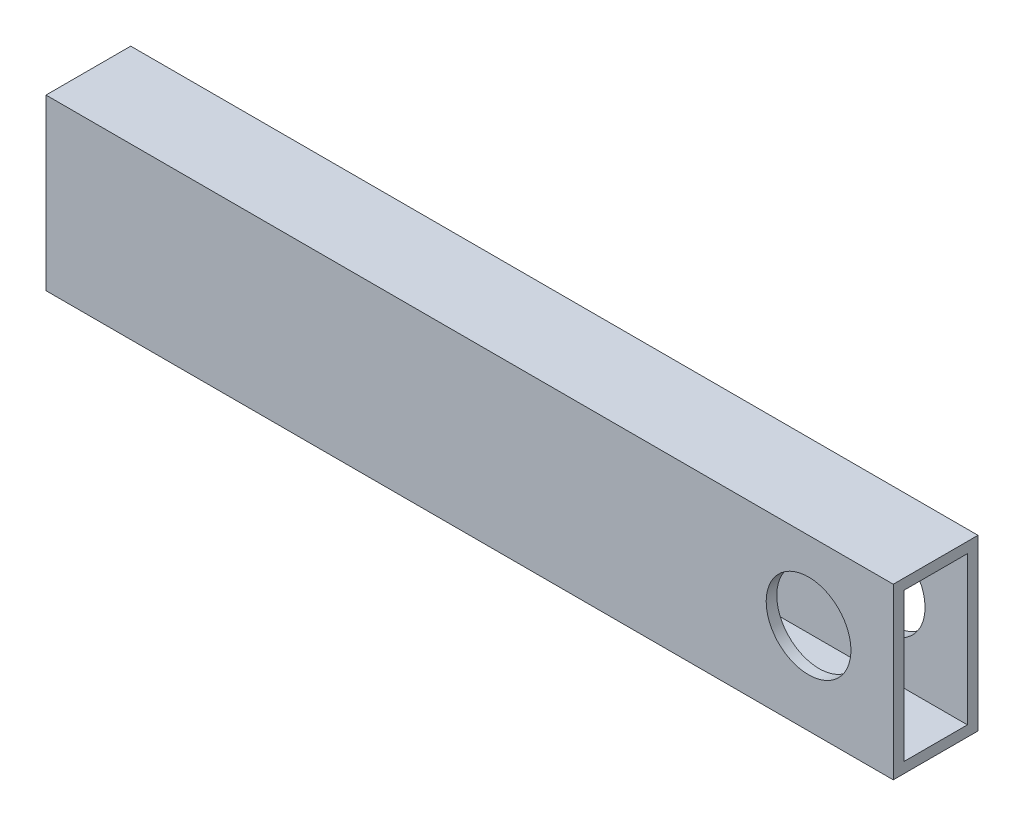
ISO-10303-21;
HEADER;
FILE_DESCRIPTION(('STEP AP214'),'2;1');
FILE_NAME('part.step','',(''),(''),'','','');
FILE_SCHEMA(('AUTOMOTIVE_DESIGN { 1 0 10303 214 1 1 1 1 }'));
ENDSEC;
DATA;
#1=APPLICATION_CONTEXT('core data for automotive mechanical design processes');
#2=APPLICATION_PROTOCOL_DEFINITION('international standard','automotive_design',2000,#1);
#3=PRODUCT_CONTEXT('',#1,'mechanical');
#4=PRODUCT('Part','Part','',(#3));
#5=PRODUCT_RELATED_PRODUCT_CATEGORY('part','',(#4));
#6=PRODUCT_DEFINITION_FORMATION('','',#4);
#7=PRODUCT_DEFINITION_CONTEXT('part definition',#1,'design');
#8=PRODUCT_DEFINITION('design','',#6,#7);
#9=PRODUCT_DEFINITION_SHAPE('','',#8);
#10=(LENGTH_UNIT() NAMED_UNIT(*) SI_UNIT(.MILLI.,.METRE.));
#11=(NAMED_UNIT(*) PLANE_ANGLE_UNIT() SI_UNIT($,.RADIAN.));
#12=(NAMED_UNIT(*) SI_UNIT($,.STERADIAN.) SOLID_ANGLE_UNIT());
#13=UNCERTAINTY_MEASURE_WITH_UNIT(LENGTH_MEASURE(1.E-05),#10,'distance_accuracy_value','');
#14=(GEOMETRIC_REPRESENTATION_CONTEXT(3) GLOBAL_UNCERTAINTY_ASSIGNED_CONTEXT((#13)) GLOBAL_UNIT_ASSIGNED_CONTEXT((#10,
#11,#12)) REPRESENTATION_CONTEXT('',''));
#15=CARTESIAN_POINT('',(0.,0.,0.));
#16=DIRECTION('',(0.,0.,1.));
#17=DIRECTION('',(1.,0.,0.));
#18=AXIS2_PLACEMENT_3D('',#15,#16,#17);
#19=CARTESIAN_POINT('',(304.8,0.,0.));
#20=DIRECTION('',(-1.,0.,0.));
#21=DIRECTION('',(0.,0.,1.));
#22=AXIS2_PLACEMENT_3D('',#19,#20,#21);
#23=PLANE('',#22);
#24=DIRECTION('',(0.,-1.,0.));
#25=VECTOR('',#24,1.);
#26=CARTESIAN_POINT('',(304.8,0.,0.));
#27=LINE('',#26,#25);
#28=CARTESIAN_POINT('',(304.8,50.8,0.));
#29=VERTEX_POINT('',#28);
#30=CARTESIAN_POINT('',(304.8,0.,0.));
#31=VERTEX_POINT('',#30);
#32=EDGE_CURVE('E164',#29,#31,#27,.T.);
#33=ORIENTED_EDGE('',*,*,#32,.T.);
#34=DIRECTION('',(0.,0.,-1.));
#35=VECTOR('',#34,1.);
#36=CARTESIAN_POINT('',(304.8,0.,0.));
#37=LINE('',#36,#35);
#38=CARTESIAN_POINT('',(304.8,0.,-25.4));
#39=VERTEX_POINT('',#38);
#40=EDGE_CURVE('E167',#31,#39,#37,.T.);
#41=ORIENTED_EDGE('',*,*,#40,.T.);
#42=DIRECTION('',(0.,1.,0.));
#43=VECTOR('',#42,1.);
#44=CARTESIAN_POINT('',(304.8,0.,-25.4));
#45=LINE('',#44,#43);
#46=CARTESIAN_POINT('',(304.8,50.8,-25.4));
#47=VERTEX_POINT('',#46);
#48=EDGE_CURVE('E169',#39,#47,#45,.T.);
#49=ORIENTED_EDGE('',*,*,#48,.T.);
#50=DIRECTION('',(0.,0.,1.));
#51=VECTOR('',#50,1.);
#52=CARTESIAN_POINT('',(304.8,50.8,0.));
#53=LINE('',#52,#51);
#54=EDGE_CURVE('E116',#47,#29,#53,.T.);
#55=ORIENTED_EDGE('',*,*,#54,.T.);
#56=EDGE_LOOP('',(#33,#41,#49,#55));
#57=FACE_BOUND('',#56,.T.);
#58=DIRECTION('',(0.,-1.,0.));
#59=VECTOR('',#58,1.);
#60=CARTESIAN_POINT('',(304.8,47.625,-3.175));
#61=LINE('',#60,#59);
#62=CARTESIAN_POINT('',(304.8,47.625,-3.175));
#63=VERTEX_POINT('',#62);
#64=CARTESIAN_POINT('',(304.8,3.175,-3.175));
#65=VERTEX_POINT('',#64);
#66=EDGE_CURVE('E143',#63,#65,#61,.T.);
#67=ORIENTED_EDGE('',*,*,#66,.F.);
#68=DIRECTION('',(0.,0.,1.));
#69=VECTOR('',#68,1.);
#70=CARTESIAN_POINT('',(304.8,47.625,-3.175));
#71=LINE('',#70,#69);
#72=CARTESIAN_POINT('',(304.8,47.625,-22.225));
#73=VERTEX_POINT('',#72);
#74=EDGE_CURVE('E150',#73,#63,#71,.T.);
#75=ORIENTED_EDGE('',*,*,#74,.F.);
#76=DIRECTION('',(0.,1.,0.));
#77=VECTOR('',#76,1.);
#78=CARTESIAN_POINT('',(304.8,47.625,-22.225));
#79=LINE('',#78,#77);
#80=CARTESIAN_POINT('',(304.8,3.175,-22.225));
#81=VERTEX_POINT('',#80);
#82=EDGE_CURVE('E147',#81,#73,#79,.T.);
#83=ORIENTED_EDGE('',*,*,#82,.F.);
#84=DIRECTION('',(0.,0.,-1.));
#85=VECTOR('',#84,1.);
#86=CARTESIAN_POINT('',(304.8,3.175,-3.175));
#87=LINE('',#86,#85);
#88=EDGE_CURVE('E145',#65,#81,#87,.T.);
#89=ORIENTED_EDGE('',*,*,#88,.F.);
#90=EDGE_LOOP('',(#67,#75,#83,#89));
#91=FACE_BOUND('',#90,.T.);
#92=ADVANCED_FACE('F34',(#57,#91),#23,.F.);
#93=CARTESIAN_POINT('',(304.8,0.,0.));
#94=DIRECTION('',(0.,0.,-1.));
#95=DIRECTION('',(-1.,0.,0.));
#96=AXIS2_PLACEMENT_3D('',#93,#94,#95);
#97=PLANE('',#96);
#98=CARTESIAN_POINT('',(279.4,27.2832700277928,0.));
#99=DIRECTION('',(0.,0.,-1.));
#100=DIRECTION('',(-1.,0.,0.));
#101=AXIS2_PLACEMENT_3D('',#98,#99,#100);
#102=CIRCLE('',#101,12.7);
#103=CARTESIAN_POINT('',(266.7,27.2832700277928,0.));
#104=VERTEX_POINT('',#103);
#105=EDGE_CURVE('E127',#104,#104,#102,.T.);
#106=ORIENTED_EDGE('',*,*,#105,.T.);
#107=EDGE_LOOP('',(#106));
#108=FACE_BOUND('',#107,.T.);
#109=DIRECTION('',(-1.,0.,0.));
#110=VECTOR('',#109,1.);
#111=CARTESIAN_POINT('',(304.8,50.8,0.));
#112=LINE('',#111,#110);
#113=CARTESIAN_POINT('',(50.8000000000001,50.8,0.));
#114=VERTEX_POINT('',#113);
#115=EDGE_CURVE('E117',#29,#114,#112,.T.);
#116=ORIENTED_EDGE('',*,*,#115,.T.);
#117=DIRECTION('',(0.,-1.,0.));
#118=VECTOR('',#117,1.);
#119=CARTESIAN_POINT('',(50.8,0.,0.));
#120=LINE('',#119,#118);
#121=CARTESIAN_POINT('',(50.8,0.,0.));
#122=VERTEX_POINT('',#121);
#123=EDGE_CURVE('E49',#114,#122,#120,.T.);
#124=ORIENTED_EDGE('',*,*,#123,.T.);
#125=DIRECTION('',(-1.,0.,0.));
#126=VECTOR('',#125,1.);
#127=CARTESIAN_POINT('',(304.8,0.,0.));
#128=LINE('',#127,#126);
#129=EDGE_CURVE('E42',#31,#122,#128,.T.);
#130=ORIENTED_EDGE('',*,*,#129,.F.);
#131=ORIENTED_EDGE('',*,*,#32,.F.);
#132=EDGE_LOOP('',(#116,#124,#130,#131));
#133=FACE_BOUND('',#132,.T.);
#134=ADVANCED_FACE('F36',(#108,#133),#97,.F.);
#135=CARTESIAN_POINT('',(304.8,0.,0.));
#136=DIRECTION('',(0.,1.,0.));
#137=DIRECTION('',(0.,0.,1.));
#138=AXIS2_PLACEMENT_3D('',#135,#136,#137);
#139=PLANE('',#138);
#140=ORIENTED_EDGE('',*,*,#129,.T.);
#141=DIRECTION('',(0.,0.,-1.));
#142=VECTOR('',#141,1.);
#143=CARTESIAN_POINT('',(50.8,0.,0.));
#144=LINE('',#143,#142);
#145=CARTESIAN_POINT('',(50.8,0.,-25.4));
#146=VERTEX_POINT('',#145);
#147=EDGE_CURVE('E137',#122,#146,#144,.T.);
#148=ORIENTED_EDGE('',*,*,#147,.T.);
#149=DIRECTION('',(-1.,0.,0.));
#150=VECTOR('',#149,1.);
#151=CARTESIAN_POINT('',(304.8,0.,-25.4));
#152=LINE('',#151,#150);
#153=EDGE_CURVE('E113',#39,#146,#152,.T.);
#154=ORIENTED_EDGE('',*,*,#153,.F.);
#155=ORIENTED_EDGE('',*,*,#40,.F.);
#156=EDGE_LOOP('',(#140,#148,#154,#155));
#157=FACE_BOUND('',#156,.T.);
#158=ADVANCED_FACE('F176',(#157),#139,.F.);
#159=CARTESIAN_POINT('',(304.8,0.,-25.4));
#160=DIRECTION('',(0.,0.,1.));
#161=DIRECTION('',(1.,0.,0.));
#162=AXIS2_PLACEMENT_3D('',#159,#160,#161);
#163=PLANE('',#162);
#164=CARTESIAN_POINT('',(279.4,27.2832700277928,-25.4));
#165=DIRECTION('',(0.,0.,1.));
#166=DIRECTION('',(1.,0.,0.));
#167=AXIS2_PLACEMENT_3D('',#164,#165,#166);
#168=CIRCLE('',#167,12.7);
#169=CARTESIAN_POINT('',(292.1,27.2832700277928,-25.4));
#170=VERTEX_POINT('',#169);
#171=EDGE_CURVE('E131',#170,#170,#168,.T.);
#172=ORIENTED_EDGE('',*,*,#171,.T.);
#173=EDGE_LOOP('',(#172));
#174=FACE_BOUND('',#173,.T.);
#175=ORIENTED_EDGE('',*,*,#153,.T.);
#176=DIRECTION('',(0.,-1.,0.));
#177=VECTOR('',#176,1.);
#178=CARTESIAN_POINT('',(50.8,50.8,-25.4));
#179=LINE('',#178,#177);
#180=CARTESIAN_POINT('',(50.8,50.8,-25.4));
#181=VERTEX_POINT('',#180);
#182=EDGE_CURVE('E98',#181,#146,#179,.T.);
#183=ORIENTED_EDGE('',*,*,#182,.F.);
#184=DIRECTION('',(-1.,0.,0.));
#185=VECTOR('',#184,1.);
#186=CARTESIAN_POINT('',(304.8,50.8,-25.4));
#187=LINE('',#186,#185);
#188=EDGE_CURVE('E110',#47,#181,#187,.T.);
#189=ORIENTED_EDGE('',*,*,#188,.F.);
#190=ORIENTED_EDGE('',*,*,#48,.F.);
#191=EDGE_LOOP('',(#175,#183,#189,#190));
#192=FACE_BOUND('',#191,.T.);
#193=ADVANCED_FACE('F108',(#174,#192),#163,.F.);
#194=CARTESIAN_POINT('',(304.8,50.8,0.));
#195=DIRECTION('',(0.,-1.,0.));
#196=DIRECTION('',(0.,0.,-1.));
#197=AXIS2_PLACEMENT_3D('',#194,#195,#196);
#198=PLANE('',#197);
#199=ORIENTED_EDGE('',*,*,#188,.T.);
#200=DIRECTION('',(0.,0.,-1.));
#201=VECTOR('',#200,1.);
#202=CARTESIAN_POINT('',(50.8,50.8,133.604));
#203=LINE('',#202,#201);
#204=EDGE_CURVE('E95',#114,#181,#203,.T.);
#205=ORIENTED_EDGE('',*,*,#204,.F.);
#206=ORIENTED_EDGE('',*,*,#115,.F.);
#207=ORIENTED_EDGE('',*,*,#54,.F.);
#208=EDGE_LOOP('',(#199,#205,#206,#207));
#209=FACE_BOUND('',#208,.T.);
#210=ADVANCED_FACE('F115',(#209),#198,.F.);
#211=CARTESIAN_POINT('',(304.8,47.625,-3.175));
#212=DIRECTION('',(0.,0.,-1.));
#213=DIRECTION('',(0.,1.,0.));
#214=AXIS2_PLACEMENT_3D('',#211,#212,#213);
#215=PLANE('',#214);
#216=DIRECTION('',(0.,-1.,0.));
#217=VECTOR('',#216,1.);
#218=CARTESIAN_POINT('',(50.8,47.625,-3.175));
#219=LINE('',#218,#217);
#220=CARTESIAN_POINT('',(50.8,47.625,-3.175));
#221=VERTEX_POINT('',#220);
#222=CARTESIAN_POINT('',(50.8,3.175,-3.175));
#223=VERTEX_POINT('',#222);
#224=EDGE_CURVE('E177',#221,#223,#219,.T.);
#225=ORIENTED_EDGE('',*,*,#224,.F.);
#226=DIRECTION('',(-1.,0.,0.));
#227=VECTOR('',#226,1.);
#228=CARTESIAN_POINT('',(304.8,47.625,-3.175));
#229=LINE('',#228,#227);
#230=EDGE_CURVE('E152',#63,#221,#229,.T.);
#231=ORIENTED_EDGE('',*,*,#230,.F.);
#232=ORIENTED_EDGE('',*,*,#66,.T.);
#233=DIRECTION('',(-1.,0.,0.));
#234=VECTOR('',#233,1.);
#235=CARTESIAN_POINT('',(304.8,3.175,-3.175));
#236=LINE('',#235,#234);
#237=EDGE_CURVE('E161',#65,#223,#236,.T.);
#238=ORIENTED_EDGE('',*,*,#237,.T.);
#239=EDGE_LOOP('',(#225,#231,#232,#238));
#240=FACE_BOUND('',#239,.T.);
#241=CARTESIAN_POINT('',(279.4,27.2832700277928,-3.175));
#242=DIRECTION('',(0.,0.,-1.));
#243=DIRECTION('',(0.,1.,0.));
#244=AXIS2_PLACEMENT_3D('',#241,#242,#243);
#245=CIRCLE('',#244,12.7);
#246=CARTESIAN_POINT('',(279.4,39.9832700277928,-3.175));
#247=VERTEX_POINT('',#246);
#248=EDGE_CURVE('E126',#247,#247,#245,.T.);
#249=ORIENTED_EDGE('',*,*,#248,.F.);
#250=EDGE_LOOP('',(#249));
#251=FACE_BOUND('',#250,.T.);
#252=ADVANCED_FACE('F199',(#240,#251),#215,.T.);
#253=CARTESIAN_POINT('',(304.8,3.175,-3.175));
#254=DIRECTION('',(0.,1.,0.));
#255=DIRECTION('',(0.,0.,1.));
#256=AXIS2_PLACEMENT_3D('',#253,#254,#255);
#257=PLANE('',#256);
#258=DIRECTION('',(0.,0.,-1.));
#259=VECTOR('',#258,1.);
#260=CARTESIAN_POINT('',(50.8,3.175,-3.175));
#261=LINE('',#260,#259);
#262=CARTESIAN_POINT('',(50.8,3.175,-22.225));
#263=VERTEX_POINT('',#262);
#264=EDGE_CURVE('E178',#223,#263,#261,.T.);
#265=ORIENTED_EDGE('',*,*,#264,.F.);
#266=ORIENTED_EDGE('',*,*,#237,.F.);
#267=ORIENTED_EDGE('',*,*,#88,.T.);
#268=DIRECTION('',(-1.,0.,0.));
#269=VECTOR('',#268,1.);
#270=CARTESIAN_POINT('',(304.8,3.175,-22.225));
#271=LINE('',#270,#269);
#272=EDGE_CURVE('E158',#81,#263,#271,.T.);
#273=ORIENTED_EDGE('',*,*,#272,.T.);
#274=EDGE_LOOP('',(#265,#266,#267,#273));
#275=FACE_BOUND('',#274,.T.);
#276=ADVANCED_FACE('F191',(#275),#257,.T.);
#277=CARTESIAN_POINT('',(304.8,47.625,-22.225));
#278=DIRECTION('',(0.,0.,1.));
#279=DIRECTION('',(0.,-1.,0.));
#280=AXIS2_PLACEMENT_3D('',#277,#278,#279);
#281=PLANE('',#280);
#282=DIRECTION('',(0.,1.,0.));
#283=VECTOR('',#282,1.);
#284=CARTESIAN_POINT('',(50.8,47.625,-22.225));
#285=LINE('',#284,#283);
#286=CARTESIAN_POINT('',(50.8000000000001,47.625,-22.225));
#287=VERTEX_POINT('',#286);
#288=EDGE_CURVE('E56',#263,#287,#285,.T.);
#289=ORIENTED_EDGE('',*,*,#288,.F.);
#290=ORIENTED_EDGE('',*,*,#272,.F.);
#291=ORIENTED_EDGE('',*,*,#82,.T.);
#292=DIRECTION('',(-1.,0.,0.));
#293=VECTOR('',#292,1.);
#294=CARTESIAN_POINT('',(304.8,47.625,-22.225));
#295=LINE('',#294,#293);
#296=EDGE_CURVE('E155',#73,#287,#295,.T.);
#297=ORIENTED_EDGE('',*,*,#296,.T.);
#298=EDGE_LOOP('',(#289,#290,#291,#297));
#299=FACE_BOUND('',#298,.T.);
#300=CARTESIAN_POINT('',(279.4,27.2832700277928,-22.225));
#301=DIRECTION('',(0.,0.,1.));
#302=DIRECTION('',(0.,-1.,0.));
#303=AXIS2_PLACEMENT_3D('',#300,#301,#302);
#304=CIRCLE('',#303,12.7);
#305=CARTESIAN_POINT('',(279.4,14.5832700277928,-22.225));
#306=VERTEX_POINT('',#305);
#307=EDGE_CURVE('E124',#306,#306,#304,.T.);
#308=ORIENTED_EDGE('',*,*,#307,.F.);
#309=EDGE_LOOP('',(#308));
#310=FACE_BOUND('',#309,.T.);
#311=ADVANCED_FACE('F188',(#299,#310),#281,.T.);
#312=CARTESIAN_POINT('',(304.8,47.625,-3.175));
#313=DIRECTION('',(0.,-1.,0.));
#314=DIRECTION('',(0.,0.,-1.));
#315=AXIS2_PLACEMENT_3D('',#312,#313,#314);
#316=PLANE('',#315);
#317=DIRECTION('',(0.,0.,1.));
#318=VECTOR('',#317,1.);
#319=CARTESIAN_POINT('',(50.8,47.625,-3.175));
#320=LINE('',#319,#318);
#321=EDGE_CURVE('E11',#287,#221,#320,.T.);
#322=ORIENTED_EDGE('',*,*,#321,.F.);
#323=ORIENTED_EDGE('',*,*,#296,.F.);
#324=ORIENTED_EDGE('',*,*,#74,.T.);
#325=ORIENTED_EDGE('',*,*,#230,.T.);
#326=EDGE_LOOP('',(#322,#323,#324,#325));
#327=FACE_BOUND('',#326,.T.);
#328=ADVANCED_FACE('F197',(#327),#316,.T.);
#329=CARTESIAN_POINT('',(279.4,27.2832700277928,0.));
#330=DIRECTION('',(0.,0.,-1.));
#331=DIRECTION('',(-1.,0.,0.));
#332=AXIS2_PLACEMENT_3D('',#329,#330,#331);
#333=CYLINDRICAL_SURFACE('',#332,12.7);
#334=ORIENTED_EDGE('',*,*,#307,.T.);
#335=EDGE_LOOP('',(#334));
#336=FACE_BOUND('',#335,.T.);
#337=ORIENTED_EDGE('',*,*,#171,.F.);
#338=EDGE_LOOP('',(#337));
#339=FACE_BOUND('',#338,.T.);
#340=ADVANCED_FACE('F208',(#336,#339),#333,.F.);
#341=ORIENTED_EDGE('',*,*,#248,.T.);
#342=EDGE_LOOP('',(#341));
#343=FACE_BOUND('',#342,.T.);
#344=ORIENTED_EDGE('',*,*,#105,.F.);
#345=EDGE_LOOP('',(#344));
#346=FACE_BOUND('',#345,.T.);
#347=ADVANCED_FACE('F205',(#343,#346),#333,.F.);
#348=CARTESIAN_POINT('',(50.8,50.8,133.604));
#349=DIRECTION('',(1.,0.,0.));
#350=DIRECTION('',(0.,0.,-1.));
#351=AXIS2_PLACEMENT_3D('',#348,#349,#350);
#352=PLANE('',#351);
#353=ORIENTED_EDGE('',*,*,#224,.T.);
#354=ORIENTED_EDGE('',*,*,#264,.T.);
#355=ORIENTED_EDGE('',*,*,#288,.T.);
#356=ORIENTED_EDGE('',*,*,#321,.T.);
#357=EDGE_LOOP('',(#353,#354,#355,#356));
#358=FACE_BOUND('',#357,.T.);
#359=ORIENTED_EDGE('',*,*,#204,.T.);
#360=ORIENTED_EDGE('',*,*,#182,.T.);
#361=ORIENTED_EDGE('',*,*,#147,.F.);
#362=ORIENTED_EDGE('',*,*,#123,.F.);
#363=EDGE_LOOP('',(#359,#360,#361,#362));
#364=FACE_BOUND('',#363,.T.);
#365=ADVANCED_FACE('F97',(#358,#364),#352,.F.);
#366=CLOSED_SHELL('',(#92,#134,#158,#193,#210,#252,#276,#311,#328,#340,#347,#365));
#367=MANIFOLD_SOLID_BREP('B2',#366);
#368=ADVANCED_BREP_SHAPE_REPRESENTATION('',(#18,#367),#14);
#369=SHAPE_DEFINITION_REPRESENTATION(#9,#368);
ENDSEC;
END-ISO-10303-21;
